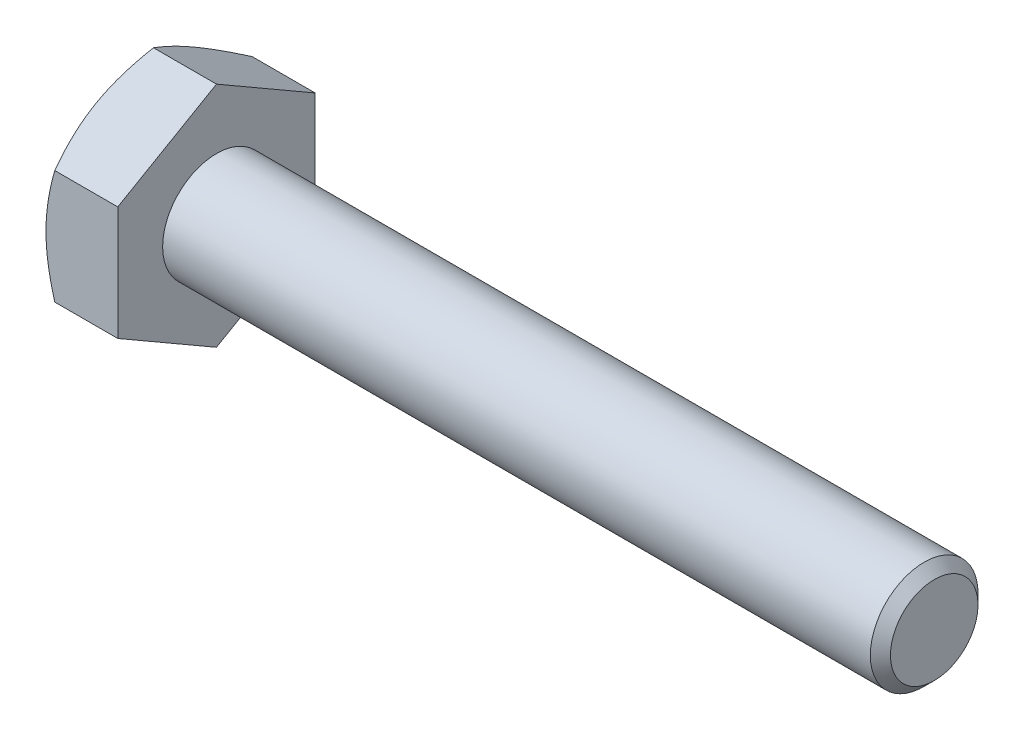
ISO-10303-21;
HEADER;
FILE_DESCRIPTION(('STEP AP214'),'2;1');
FILE_NAME('part.step','',(''),(''),'','','');
FILE_SCHEMA(('AUTOMOTIVE_DESIGN { 1 0 10303 214 1 1 1 1 }'));
ENDSEC;
DATA;
#1=APPLICATION_CONTEXT('core data for automotive mechanical design processes');
#2=APPLICATION_PROTOCOL_DEFINITION('international standard','automotive_design',2000,#1);
#3=PRODUCT_CONTEXT('',#1,'mechanical');
#4=PRODUCT('Part','Part','',(#3));
#5=PRODUCT_RELATED_PRODUCT_CATEGORY('part','',(#4));
#6=PRODUCT_DEFINITION_FORMATION('','',#4);
#7=PRODUCT_DEFINITION_CONTEXT('part definition',#1,'design');
#8=PRODUCT_DEFINITION('design','',#6,#7);
#9=PRODUCT_DEFINITION_SHAPE('','',#8);
#10=(LENGTH_UNIT() NAMED_UNIT(*) SI_UNIT(.MILLI.,.METRE.));
#11=(NAMED_UNIT(*) PLANE_ANGLE_UNIT() SI_UNIT($,.RADIAN.));
#12=(NAMED_UNIT(*) SI_UNIT($,.STERADIAN.) SOLID_ANGLE_UNIT());
#13=UNCERTAINTY_MEASURE_WITH_UNIT(LENGTH_MEASURE(1.E-05),#10,'distance_accuracy_value','');
#14=(GEOMETRIC_REPRESENTATION_CONTEXT(3) GLOBAL_UNCERTAINTY_ASSIGNED_CONTEXT((#13)) GLOBAL_UNIT_ASSIGNED_CONTEXT((#10,
#11,#12)) REPRESENTATION_CONTEXT('',''));
#15=CARTESIAN_POINT('',(0.,0.,0.));
#16=DIRECTION('',(0.,0.,1.));
#17=DIRECTION('',(1.,0.,0.));
#18=AXIS2_PLACEMENT_3D('',#15,#16,#17);
#19=CARTESIAN_POINT('',(0.247093813641186,0.,0.));
#20=DIRECTION('',(1.,0.,0.));
#21=DIRECTION('',(0.,0.,-1.));
#22=AXIS2_PLACEMENT_3D('',#19,#20,#21);
#23=CONICAL_SURFACE('',#22,3.17797903943529,1.04719755123487);
#24=CARTESIAN_POINT('',(0.245620125353297,1.58771319441333,2.75000000445292));
#25=CARTESIAN_POINT('',(0.208302611422687,1.65233280567374,2.63807560337087));
#26=CARTESIAN_POINT('',(0.174113261156258,1.71746990227843,2.52525486193825));
#27=CARTESIAN_POINT('',(0.113820963780644,1.84831826254583,2.29861886752376));
#28=CARTESIAN_POINT('',(0.0876780311517107,1.91402496214773,2.1848115198531));
#29=CARTESIAN_POINT('',(0.0555789468827624,2.01320512582813,2.01302643538274));
#30=CARTESIAN_POINT('',(0.0460612413090582,2.04639046653045,1.95554773967643));
#31=CARTESIAN_POINT('',(0.0295858946939324,2.11292001944978,1.84031517415182));
#32=CARTESIAN_POINT('',(0.0226281862702107,2.14626422746179,1.78256131161678));
#33=CARTESIAN_POINT('',(0.0113950805415364,2.21323485146645,1.66656478812953));
#34=CARTESIAN_POINT('',(0.00713332393689443,2.24686184385269,1.60832112883504));
#35=CARTESIAN_POINT('',(0.00142988484881121,2.31418196205708,1.49171926378192));
#36=CARTESIAN_POINT('',(-1.12391256473976E-05,2.34787509965072,1.43336103762754));
#37=CARTESIAN_POINT('',(3.7544688643896E-11,2.38156986040678,1.37500000000073));
#38=B_SPLINE_CURVE_WITH_KNOTS('',3,(#24,#25,#26,#27,#28,#29,#30,#31,#32,#33,#34,#35,#36,#37),
.UNSPECIFIED.,.F.,.F.,(4,2,2,2,2,2,4),(0.,0.40372017155036,0.805400455914915,1.00650414182376,
1.20760253405543,1.40971045201377,1.61185838499262),.UNSPECIFIED.);
#39=CARTESIAN_POINT('',(0.245620097887813,1.58771323194011,2.75000001443034));
#40=VERTEX_POINT('',#39);
#41=CARTESIAN_POINT('',(1.87722046035099E-11,2.38156986037905,1.37499999998374));
#42=VERTEX_POINT('',#41);
#43=EDGE_CURVE('E97',#40,#42,#38,.T.);
#44=ORIENTED_EDGE('',*,*,#43,.T.);
#45=CARTESIAN_POINT('',(0.,0.,0.));
#46=DIRECTION('',(1.,0.,0.));
#47=DIRECTION('',(0.,0.,-1.));
#48=AXIS2_PLACEMENT_3D('',#45,#46,#47);
#49=CIRCLE('',#48,2.74999999993497);
#50=CARTESIAN_POINT('',(1.87723355258448E-11,0.,2.74999999996749));
#51=VERTEX_POINT('',#50);
#52=EDGE_CURVE('E99',#42,#51,#49,.T.);
#53=ORIENTED_EDGE('',*,*,#52,.T.);
#54=CARTESIAN_POINT('',(4.22381346782145E-11,0.,2.74999999999187));
#55=CARTESIAN_POINT('',(-1.12391058102522E-05,0.0673895163244944,2.74999999999708));
#56=CARTESIAN_POINT('',(0.00142988463489068,0.134775786268163,2.74999999999922));
#57=CARTESIAN_POINT('',(0.00713332282774625,0.269416012273883,2.75000000000078));
#58=CARTESIAN_POINT('',(0.0113950787733437,0.336669991886818,2.75000000000021));
#59=CARTESIAN_POINT('',(0.022628182843835,0.470611229931148,2.74999999999979));
#60=CARTESIAN_POINT('',(0.0295858902768044,0.537299641148356,2.74999999999994));
#61=CARTESIAN_POINT('',(0.0460612343882111,0.670358736952928,2.75000000000006));
#62=CARTESIAN_POINT('',(0.0555789384476848,0.736729413130461,2.75000000000002));
#63=CARTESIAN_POINT('',(0.0876780186705048,0.935089727171406,2.74999999999996));
#64=CARTESIAN_POINT('',(0.113820949287115,1.06650312094283,2.74999999999998));
#65=CARTESIAN_POINT('',(0.174113234168371,1.32819981107726,2.75000000000002));
#66=CARTESIAN_POINT('',(0.208302573892446,1.45847397922507,2.75000000000004));
#67=CARTESIAN_POINT('',(0.245620068079388,1.58771315367478,2.75));
#68=B_SPLINE_CURVE_WITH_KNOTS('',3,(#54,#55,#56,#57,#58,#59,#60,#61,#62,#63,#64,#65,#66,#67),
.UNSPECIFIED.,.F.,.F.,(4,2,2,2,2,2,4),(0.,0.202147917307019,0.404255819764308,0.605354197062228,
0.806457867938704,1.20813812131784,1.61185826082473),.UNSPECIFIED.);
#69=EDGE_CURVE('E20',#51,#40,#68,.T.);
#70=ORIENTED_EDGE('',*,*,#69,.T.);
#71=EDGE_LOOP('',(#44,#53,#70));
#72=FACE_BOUND('',#71,.T.);
#73=ADVANCED_FACE('F16',(#72),#23,.T.);
#74=CARTESIAN_POINT('',(0.247093813641186,0.,0.));
#75=DIRECTION('',(1.,0.,0.));
#76=DIRECTION('',(0.,0.,-1.));
#77=AXIS2_PLACEMENT_3D('',#74,#75,#76);
#78=CONICAL_SURFACE('',#77,3.17797903943529,1.04719755123487);
#79=CARTESIAN_POINT('',(0.,0.,0.));
#80=DIRECTION('',(1.,0.,0.));
#81=DIRECTION('',(0.,0.,-1.));
#82=AXIS2_PLACEMENT_3D('',#79,#80,#81);
#83=CIRCLE('',#82,2.74999999993497);
#84=CARTESIAN_POINT('',(1.87714326470167E-11,-2.38156986037904,1.37499999998375));
#85=VERTEX_POINT('',#84);
#86=EDGE_CURVE('E105',#51,#85,#83,.T.);
#87=ORIENTED_EDGE('',*,*,#86,.T.);
#88=CARTESIAN_POINT('',(4.22355327327212E-11,-2.38156986040016,1.37499999999594));
#89=CARTESIAN_POINT('',(-1.12391090629137E-05,-2.34787509976059,1.43336103738297));
#90=CARTESIAN_POINT('',(0.00142988484548734,-2.31418196230934,1.4917192633192));
#91=CARTESIAN_POINT('',(0.00713332387587586,-2.2468618443607,1.60832112798091));
#92=CARTESIAN_POINT('',(0.0113950804449148,-2.21323485208785,1.66656478710207));
#93=CARTESIAN_POINT('',(0.0226281861408932,-2.14626422818741,1.78256131031138));
#94=CARTESIAN_POINT('',(0.0295858945726209,-2.11292002016673,1.84031517274164));
#95=CARTESIAN_POINT('',(0.0460612410196586,-2.04639046747194,1.95554773821407));
#96=CARTESIAN_POINT('',(0.0555789464160417,-2.01320512700276,2.0130264339731));
#97=CARTESIAN_POINT('',(0.0876780310743108,-1.91402496292124,2.18481151726518));
#98=CARTESIAN_POINT('',(0.113820965219894,-1.8483182614099,2.29861886268063));
#99=CARTESIAN_POINT('',(0.174113257978256,-1.71746990717717,2.52525486029856));
#100=CARTESIAN_POINT('',(0.208302602058572,-1.65233281856459,2.63807560723271));
#101=CARTESIAN_POINT('',(0.245620100813993,-1.58771322687181,2.75000002320889));
#102=B_SPLINE_CURVE_WITH_KNOTS('',3,(#88,#89,#90,#91,#92,#93,#94,#95,#96,#97,#98,#99,#100,#101),
.UNSPECIFIED.,.F.,.F.,(4,2,2,2,2,2,4),(0.,0.202147932192761,0.404255849521308,0.605354241514827,
0.806457927089489,1.20813820971334,1.61185837882308),.UNSPECIFIED.);
#103=CARTESIAN_POINT('',(0.245620080576418,-1.58771319696576,2.75));
#104=VERTEX_POINT('',#103);
#105=EDGE_CURVE('E113',#85,#104,#102,.T.);
#106=ORIENTED_EDGE('',*,*,#105,.T.);
#107=CARTESIAN_POINT('',(0.245620068075139,-1.58771315366006,2.75));
#108=CARTESIAN_POINT('',(0.208302573888836,-1.45847397921159,2.75));
#109=CARTESIAN_POINT('',(0.174113234165332,-1.32819981106503,2.75));
#110=CARTESIAN_POINT('',(0.113820949285087,-1.06650312093308,2.75));
#111=CARTESIAN_POINT('',(0.087678018668921,-0.935089727162875,2.75));
#112=CARTESIAN_POINT('',(0.0555789384467154,-0.736729413123844,2.75));
#113=CARTESIAN_POINT('',(0.0460612343874404,-0.670358736946991,2.75));
#114=CARTESIAN_POINT('',(0.0295858902762722,-0.537299641143775,2.75));
#115=CARTESIAN_POINT('',(0.0226281828433432,-0.470611229927245,2.75));
#116=CARTESIAN_POINT('',(0.0113950787732987,-0.336669991884315,2.75));
#117=CARTESIAN_POINT('',(0.00713332282810784,-0.269416012272102,2.75));
#118=CARTESIAN_POINT('',(0.00142988463444215,-0.134775786267896,2.75));
#119=CARTESIAN_POINT('',(-1.12391074772275E-05,-0.0673895163250198,2.75));
#120=CARTESIAN_POINT('',(3.75448565939036E-11,-1.35484145061668E-12,2.75));
#121=B_SPLINE_CURVE_WITH_KNOTS('',3,(#107,#108,#109,#110,#111,#112,#113,#114,#115,#116,#117,
#118,#119,#120),.UNSPECIFIED.,.F.,.F.,(4,2,2,2,2,2,4),(0.,0.403720139502818,0.805400392878097,
1.00650406375248,1.20760244104835,1.40971034350344,1.61185826080816),.UNSPECIFIED.);
#122=EDGE_CURVE('E92',#104,#51,#121,.T.);
#123=ORIENTED_EDGE('',*,*,#122,.T.);
#124=EDGE_LOOP('',(#87,#106,#123));
#125=FACE_BOUND('',#124,.T.);
#126=ADVANCED_FACE('F111',(#125),#78,.T.);
#127=CARTESIAN_POINT('',(0.247093813641186,0.,0.));
#128=DIRECTION('',(1.,0.,0.));
#129=DIRECTION('',(0.,0.,-1.));
#130=AXIS2_PLACEMENT_3D('',#127,#128,#129);
#131=CONICAL_SURFACE('',#130,3.17797903943529,1.04719755123487);
#132=CARTESIAN_POINT('',(0.,0.,0.));
#133=DIRECTION('',(1.,0.,0.));
#134=DIRECTION('',(0.,0.,-1.));
#135=AXIS2_PLACEMENT_3D('',#132,#133,#134);
#136=CIRCLE('',#135,2.74999999993497);
#137=CARTESIAN_POINT('',(1.87728723651738E-11,-2.38156986037905,-1.37499999998374));
#138=VERTEX_POINT('',#137);
#139=EDGE_CURVE('E119',#85,#138,#136,.T.);
#140=ORIENTED_EDGE('',*,*,#139,.T.);
#141=CARTESIAN_POINT('',(4.22390068352306E-11,-2.38156986040017,-1.37499999999593));
#142=CARTESIAN_POINT('',(-1.12391090599107E-05,-2.41526462104877,-1.31663896261411));
#143=CARTESIAN_POINT('',(0.00142988484549062,-2.44895775850372,-1.25828073668));
#144=CARTESIAN_POINT('',(0.00713332387588072,-2.51627787645508,-1.14167887201984));
#145=CARTESIAN_POINT('',(0.0113950804449209,-2.54990486872695,-1.0834352128981));
#146=CARTESIAN_POINT('',(0.0226281861409026,-2.61687549262667,-0.967438689688359));
#147=CARTESIAN_POINT('',(0.0295858945726322,-2.65021970064762,-0.909684827258233));
#148=CARTESIAN_POINT('',(0.0460612410196744,-2.71674925334261,-0.794452261785903));
#149=CARTESIAN_POINT('',(0.0555789464160601,-2.74993459381174,-0.736973566026831));
#150=CARTESIAN_POINT('',(0.0876780310743379,-2.84911475789316,-0.565188482734663));
#151=CARTESIAN_POINT('',(0.113820965219928,-2.91482145940455,-0.451381137319217));
#152=CARTESIAN_POINT('',(0.174113257978306,-3.04566981363736,-0.224745139701297));
#153=CARTESIAN_POINT('',(0.20830260205863,-3.11080690224999,-0.111924392767153));
#154=CARTESIAN_POINT('',(0.24562010081406,-3.17542649394271,2.32090819950531E-08));
#155=B_SPLINE_CURVE_WITH_KNOTS('',3,(#141,#142,#143,#144,#145,#146,#147,#148,#149,#150,#151,
#152,#153,#154),.UNSPECIFIED.,.F.,.F.,(4,2,2,2,2,2,4),(0.,0.20214793219279,0.404255849521367,
0.605354241514915,0.806457927089606,1.20813820971351,1.61185837882331),.UNSPECIFIED.);
#156=CARTESIAN_POINT('',(0.245620080576386,-3.17542645889003,3.75039411458215E-08));
#157=VERTEX_POINT('',#156);
#158=EDGE_CURVE('E173',#138,#157,#155,.T.);
#159=ORIENTED_EDGE('',*,*,#158,.T.);
#160=CARTESIAN_POINT('',(0.245620068075073,-3.17542643723712,7.5007882291606E-08));
#161=CARTESIAN_POINT('',(0.208302573888778,-3.11080685001289,0.111924483244372));
#162=CARTESIAN_POINT('',(0.174113234165283,-3.04566976593963,0.224745222316159));
#163=CARTESIAN_POINT('',(0.113820949285053,-2.91482142087366,0.451381204056706));
#164=CARTESIAN_POINT('',(0.0876780186688948,-2.84911472398857,0.565188541459212));
#165=CARTESIAN_POINT('',(0.0555789384466978,-2.74993456696907,0.736973612519647));
#166=CARTESIAN_POINT('',(0.0460612343874254,-2.71674922888065,0.794452304155145));
#167=CARTESIAN_POINT('',(0.0295858902762617,-2.65021968097905,0.9096848613253));
#168=CARTESIAN_POINT('',(0.0226281828433347,-2.61687547537079,0.96743871957683));
#169=CARTESIAN_POINT('',(0.0113950787732934,-2.54990485634933,1.08343523433633));
#170=CARTESIAN_POINT('',(0.00713332282810379,-2.51627786654323,1.1416788891861));
#171=CARTESIAN_POINT('',(0.00142988463443976,-2.44895775354114,1.258280745277));
#172=CARTESIAN_POINT('',(-1.12391074792164E-05,-2.41526461856971,1.3166389669138));
#173=CARTESIAN_POINT('',(3.75428068345179E-11,-2.38156986040788,1.37499999999883));
#174=B_SPLINE_CURVE_WITH_KNOTS('',3,(#160,#161,#162,#163,#164,#165,#166,#167,#168,#169,#170,
#171,#172,#173),.UNSPECIFIED.,.F.,.F.,(4,2,2,2,2,2,4),(0.,0.40372013950276,0.80540039287798,
1.00650406375234,1.20760244104817,1.40971034350323,1.61185826080793),.UNSPECIFIED.);
#175=EDGE_CURVE('E191',#157,#85,#174,.T.);
#176=ORIENTED_EDGE('',*,*,#175,.T.);
#177=EDGE_LOOP('',(#140,#159,#176));
#178=FACE_BOUND('',#177,.T.);
#179=ADVANCED_FACE('F156',(#178),#131,.T.);
#180=CARTESIAN_POINT('',(0.247093813641186,0.,0.));
#181=DIRECTION('',(1.,0.,0.));
#182=DIRECTION('',(0.,0.,-1.));
#183=AXIS2_PLACEMENT_3D('',#180,#181,#182);
#184=CONICAL_SURFACE('',#183,3.17797903943529,1.04719755123487);
#185=CARTESIAN_POINT('',(0.,0.,0.));
#186=DIRECTION('',(1.,0.,0.));
#187=DIRECTION('',(0.,0.,-1.));
#188=AXIS2_PLACEMENT_3D('',#185,#186,#187);
#189=CIRCLE('',#188,2.74999999993497);
#190=CARTESIAN_POINT('',(1.87723179206211E-11,0.,-2.74999999996749));
#191=VERTEX_POINT('',#190);
#192=EDGE_CURVE('E121',#138,#191,#189,.T.);
#193=ORIENTED_EDGE('',*,*,#192,.T.);
#194=CARTESIAN_POINT('',(4.22375984152944E-11,0.,-2.74999999999187));
#195=CARTESIAN_POINT('',(-1.12391090603024E-05,-0.0673895212871096,-2.74999999999708));
#196=CARTESIAN_POINT('',(0.00142988484544432,-0.134775796192243,-2.74999999999922));
#197=CARTESIAN_POINT('',(0.00713332387565435,-0.269416032090136,-2.75000000000078));
#198=CARTESIAN_POINT('',(0.0113950804445604,-0.33667001663379,-2.75000000000021));
#199=CARTESIAN_POINT('',(0.0226281861401926,-0.470611264431866,-2.74999999999979));
#200=CARTESIAN_POINT('',(0.0295858945717077,-0.537299680472463,-2.74999999999994));
#201=CARTESIAN_POINT('',(0.0460612410182478,-0.67035878586019,-2.75000000000006));
#202=CARTESIAN_POINT('',(0.0555789464143461,-0.736729466797483,-2.75000000000002));
#203=CARTESIAN_POINT('',(0.0876780310716703,-0.935089794957403,-2.74999999999996));
#204=CARTESIAN_POINT('',(0.113820965216502,-1.06650319797815,-2.74999999999998));
#205=CARTESIAN_POINT('',(0.174113257973186,-1.32819990643977,-2.75000000000002));
#206=CARTESIAN_POINT('',(0.208302602052574,-1.45847408366303,-2.75000000000004));
#207=CARTESIAN_POINT('',(0.245620100807022,-1.58771326704663,-2.75));
#208=B_SPLINE_CURVE_WITH_KNOTS('',3,(#194,#195,#196,#197,#198,#199,#200,#201,#202,#203,#204,
#205,#206,#207),.UNSPECIFIED.,.F.,.F.,(4,2,2,2,2,2,4),(0.,0.20214793218959,0.40425584951497,
0.605354241505359,0.80645792707689,1.20813820969451,1.61185837879794),.UNSPECIFIED.);
#209=CARTESIAN_POINT('',(0.245620080573249,-1.58771326192994,-2.74999996248657));
#210=VERTEX_POINT('',#209);
#211=EDGE_CURVE('E160',#191,#210,#208,.T.);
#212=ORIENTED_EDGE('',*,*,#211,.T.);
#213=CARTESIAN_POINT('',(0.24562006806875,-1.58771328358825,-2.74999992497315));
#214=CARTESIAN_POINT('',(0.208302573883339,-1.65233287081161,-2.63807551673815));
#215=CARTESIAN_POINT('',(0.174113234160685,-1.717469954884,-2.52525477766789));
#216=CARTESIAN_POINT('',(0.113820949281977,-1.84831829994819,-2.2986187959304));
#217=CARTESIAN_POINT('',(0.0876780186665004,-1.91402499683239,-2.18481145852945));
#218=CARTESIAN_POINT('',(0.0555789384451608,-2.01320515385053,-2.01302638747137));
#219=CARTESIAN_POINT('',(0.046061234386147,-2.04639049193849,-1.95554769583667));
#220=CARTESIAN_POINT('',(0.0295858902754346,-2.11292003983916,-1.84031513866812));
#221=CARTESIAN_POINT('',(0.0226281828427004,-2.14626424544696,-1.7825612804174));
#222=CARTESIAN_POINT('',(0.011395078772973,-2.21323486446747,-1.66656476565953));
#223=CARTESIAN_POINT('',(0.00713332282790397,-2.24686185427309,-1.60832111081059));
#224=CARTESIAN_POINT('',(0.00142988463440191,-2.31418196727423,-1.49171925472134));
#225=CARTESIAN_POINT('',(-1.123910747566E-05,-2.34787510224518,-1.43336103308537));
#226=CARTESIAN_POINT('',(3.75457547262337E-11,-2.38156986040653,-1.37500000000117));
#227=B_SPLINE_CURVE_WITH_KNOTS('',3,(#213,#214,#215,#216,#217,#218,#219,#220,#221,#222,#223,
#224,#225,#226),.UNSPECIFIED.,.F.,.F.,(4,2,2,2,2,2,4),(0.,0.40372013949704,0.80540039286661,
1.00650406373812,1.20760244103112,1.40971034348331,1.61185826078513),.UNSPECIFIED.);
#228=EDGE_CURVE('E166',#210,#138,#227,.T.);
#229=ORIENTED_EDGE('',*,*,#228,.T.);
#230=EDGE_LOOP('',(#193,#212,#229));
#231=FACE_BOUND('',#230,.T.);
#232=ADVANCED_FACE('F149',(#231),#184,.T.);
#233=CARTESIAN_POINT('',(0.247093813641186,0.,0.));
#234=DIRECTION('',(1.,0.,0.));
#235=DIRECTION('',(0.,0.,-1.));
#236=AXIS2_PLACEMENT_3D('',#233,#234,#235);
#237=CONICAL_SURFACE('',#236,3.17797903943529,1.04719755123487);
#238=CARTESIAN_POINT('',(0.245620125363753,1.5877132670472,-2.74999996249191));
#239=CARTESIAN_POINT('',(0.208302611425352,1.45847408677907,-2.74999998689824));
#240=CARTESIAN_POINT('',(0.174113261155965,1.32819991032352,-2.74999999657558));
#241=CARTESIAN_POINT('',(0.113820963778544,1.06650320161643,-2.75000000340712));
#242=CARTESIAN_POINT('',(0.0876780311507348,0.935089797595657,-2.75000000062437));
#243=CARTESIAN_POINT('',(0.0555789468823758,0.73672946861369,-2.74999999968741));
#244=CARTESIAN_POINT('',(0.0460612413086893,0.670358787604863,-2.74999999991583));
#245=CARTESIAN_POINT('',(0.029585894693669,0.537299682058404,-2.75000000008417));
#246=CARTESIAN_POINT('',(0.0226281862700343,0.470611265930763,-2.7500000000241));
#247=CARTESIAN_POINT('',(0.0113950805414743,0.33667001783851,-2.74999999997578));
#248=CARTESIAN_POINT('',(0.0071333239368618,0.269416033087326,-2.74999999998789));
#249=CARTESIAN_POINT('',(0.00142988484880882,0.134775796721124,-2.75000000001211));
#250=CARTESIAN_POINT('',(-1.12391256478905E-05,0.0673895215551175,-2.75000000002423));
#251=CARTESIAN_POINT('',(3.75446358412427E-11,1.35487812364647E-12,-2.75));
#252=B_SPLINE_CURVE_WITH_KNOTS('',3,(#238,#239,#240,#241,#242,#243,#244,#245,#246,#247,#248,
#249,#250,#251),.UNSPECIFIED.,.F.,.F.,(4,2,2,2,2,2,4),(0.,0.403720171549025,0.805400455911902,
1.00650414181961,1.2076025340501,1.40971045200744,1.61185838498538),.UNSPECIFIED.);
#253=CARTESIAN_POINT('',(0.245620097886926,1.58771325693112,-2.75));
#254=VERTEX_POINT('',#253);
#255=EDGE_CURVE('E106',#254,#191,#252,.T.);
#256=ORIENTED_EDGE('',*,*,#255,.T.);
#257=CARTESIAN_POINT('',(0.,0.,0.));
#258=DIRECTION('',(1.,0.,0.));
#259=DIRECTION('',(0.,0.,-1.));
#260=AXIS2_PLACEMENT_3D('',#257,#258,#259);
#261=CIRCLE('',#260,2.74999999993497);
#262=CARTESIAN_POINT('',(1.87719592567345E-11,2.38156986037905,-1.37499999998375));
#263=VERTEX_POINT('',#262);
#264=EDGE_CURVE('E341',#191,#263,#261,.T.);
#265=ORIENTED_EDGE('',*,*,#264,.T.);
#266=CARTESIAN_POINT('',(4.04770625747497E-11,2.3815698604028,-1.37499999999746));
#267=CARTESIAN_POINT('',(-1.12391064425941E-05,2.34787510224422,-1.43336103308339));
#268=CARTESIAN_POINT('',(0.00142988463464879,2.31418196727438,-1.4917192547201));
#269=CARTESIAN_POINT('',(0.00713332282756166,2.24686185427402,-1.60832111080995));
#270=CARTESIAN_POINT('',(0.0113950787728266,2.21323486446806,-1.66656476565876));
#271=CARTESIAN_POINT('',(0.022628182842686,2.14626424544729,-1.78256128041656));
#272=CARTESIAN_POINT('',(0.0295858902753566,2.11292003983956,-1.84031513866735));
#273=CARTESIAN_POINT('',(0.0460612343860133,2.04639049193892,-1.95554769583599));
#274=CARTESIAN_POINT('',(0.0555789384450353,2.01320515385092,-2.01302638747071));
#275=CARTESIAN_POINT('',(0.0876780186663767,1.91402499683273,-2.1848114585288));
#276=CARTESIAN_POINT('',(0.11382094928183,1.84831829994854,-2.29861879592977));
#277=CARTESIAN_POINT('',(0.174113234160503,1.71746995488435,-2.5252547776673));
#278=CARTESIAN_POINT('',(0.208302573883146,1.65233287081195,-2.63807551673761));
#279=CARTESIAN_POINT('',(0.245620068068574,1.58771328358854,-2.74999992497263));
#280=B_SPLINE_CURVE_WITH_KNOTS('',3,(#266,#267,#268,#269,#270,#271,#272,#273,#274,#275,#276,
#277,#278,#279),.UNSPECIFIED.,.F.,.F.,(4,2,2,2,2,2,4),(0.,0.20214791730203,0.40425581975437,
0.605354197047443,0.806457867919058,1.20813812128863,1.61185826078579),.UNSPECIFIED.);
#281=EDGE_CURVE('E133',#263,#254,#280,.T.);
#282=ORIENTED_EDGE('',*,*,#281,.T.);
#283=EDGE_LOOP('',(#256,#265,#282));
#284=FACE_BOUND('',#283,.T.);
#285=ADVANCED_FACE('F144',(#284),#237,.T.);
#286=CARTESIAN_POINT('',(0.,3.17542648054294,0.));
#287=DIRECTION('',(1.,0.,0.));
#288=DIRECTION('',(0.,0.,-1.));
#289=AXIS2_PLACEMENT_3D('',#286,#287,#288);
#290=PLANE('',#289);
#291=ORIENTED_EDGE('',*,*,#192,.F.);
#292=ORIENTED_EDGE('',*,*,#139,.F.);
#293=ORIENTED_EDGE('',*,*,#86,.F.);
#294=ORIENTED_EDGE('',*,*,#52,.F.);
#295=CARTESIAN_POINT('',(0.,0.,0.));
#296=DIRECTION('',(1.,0.,0.));
#297=DIRECTION('',(0.,0.,-1.));
#298=AXIS2_PLACEMENT_3D('',#295,#296,#297);
#299=CIRCLE('',#298,2.74999999993497);
#300=EDGE_CURVE('E342',#263,#42,#299,.T.);
#301=ORIENTED_EDGE('',*,*,#300,.F.);
#302=ORIENTED_EDGE('',*,*,#264,.F.);
#303=EDGE_LOOP('',(#291,#292,#293,#294,#301,#302));
#304=FACE_BOUND('',#303,.T.);
#305=ADVANCED_FACE('F117',(#304),#290,.F.);
#306=CARTESIAN_POINT('',(0.247093813641186,0.,0.));
#307=DIRECTION('',(1.,0.,0.));
#308=DIRECTION('',(0.,0.,-1.));
#309=AXIS2_PLACEMENT_3D('',#306,#307,#308);
#310=CONICAL_SURFACE('',#309,3.17797903943529,1.04719755123487);
#311=CARTESIAN_POINT('',(0.245620093076482,3.17542648054083,-3.65471337437153E-12));
#312=CARTESIAN_POINT('',(0.20830259540095,3.11080688990418,-0.111924414150638));
#313=CARTESIAN_POINT('',(0.174113252350319,3.04566980236441,-0.224745159226576));
#314=CARTESIAN_POINT('',(0.113820961453852,2.91482145029813,-0.451381153092039));
#315=CARTESIAN_POINT('',(0.0876780281423978,2.84911474988013,-0.565188496613726));
#316=CARTESIAN_POINT('',(0.0555789445325779,2.74993458746769,-0.736973577015006));
#317=CARTESIAN_POINT('',(0.0460612394522271,2.71674924756121,-0.794452271799471));
#318=CARTESIAN_POINT('',(0.0295858935572031,2.65021969599919,-0.90968483530966));
#319=CARTESIAN_POINT('',(0.022628185361466,2.61687548854857,-0.967438696752252));
#320=CARTESIAN_POINT('',(0.0113950800499481,2.54990486580153,-1.08343521796464));
#321=CARTESIAN_POINT('',(0.00713332362860263,2.51627787411207,-1.14167887607648));
#322=CARTESIAN_POINT('',(0.00142988479527443,2.44895775733153,-1.25828073871186));
#323=CARTESIAN_POINT('',(-1.12391099678723E-05,2.41526462046499,-1.31663896363107));
#324=CARTESIAN_POINT('',(3.75440665419617E-11,2.38156986040763,-1.37499999999927));
#325=B_SPLINE_CURVE_WITH_KNOTS('',3,(#311,#312,#313,#314,#315,#316,#317,#318,#319,#320,#321,
#322,#323,#324),.UNSPECIFIED.,.F.,.F.,(4,2,2,2,2,2,4),(0.,0.403720162112379,0.805400437823692,
1.00650411992401,1.20760250844383,1.40971042225704,1.61185835093094),.UNSPECIFIED.);
#326=CARTESIAN_POINT('',(0.245620093076482,3.17542648054083,0.));
#327=VERTEX_POINT('',#326);
#328=EDGE_CURVE('E256',#327,#263,#325,.T.);
#329=ORIENTED_EDGE('',*,*,#328,.T.);
#330=ORIENTED_EDGE('',*,*,#300,.T.);
#331=CARTESIAN_POINT('',(4.04780477563994E-11,2.38156986040281,1.37499999999746));
#332=CARTESIAN_POINT('',(-1.12391089250852E-05,2.41526462046305,1.31663896363079));
#333=CARTESIAN_POINT('',(0.00142988479553836,2.44895775733079,1.25828073871217));
#334=CARTESIAN_POINT('',(0.00713332362829232,2.51627787411225,1.14167887607715));
#335=CARTESIAN_POINT('',(0.0113950800498413,2.54990486580143,1.08343521796509));
#336=CARTESIAN_POINT('',(0.0226281853615065,2.61687548854828,0.967438696752498));
#337=CARTESIAN_POINT('',(0.0295858935571877,2.650219695999,0.909684835309925));
#338=CARTESIAN_POINT('',(0.0460612394521711,2.71674924756111,0.794452271799711));
#339=CARTESIAN_POINT('',(0.0555789445325375,2.74993458746759,0.736973577015202));
#340=CARTESIAN_POINT('',(0.0876780281423815,2.84911474988002,0.565188496613858));
#341=CARTESIAN_POINT('',(0.113820961453827,2.91482145029804,0.451381153092166));
#342=CARTESIAN_POINT('',(0.174113252350287,3.04566980236438,0.224745159226663));
#343=CARTESIAN_POINT('',(0.208302595400922,3.11080688990418,0.111924414150691));
#344=CARTESIAN_POINT('',(0.245620093076482,3.17542648054083,3.65516474206373E-12));
#345=B_SPLINE_CURVE_WITH_KNOTS('',3,(#331,#332,#333,#334,#335,#336,#337,#338,#339,#340,#341,
#342,#343,#344),.UNSPECIFIED.,.F.,.F.,(4,2,2,2,2,2,4),(0.,0.20214792867413,0.404255842487507,
0.60535423100742,0.806457913107851,1.2081381888192,1.61185835093172),.UNSPECIFIED.);
#346=EDGE_CURVE('E249',#42,#327,#345,.T.);
#347=ORIENTED_EDGE('',*,*,#346,.T.);
#348=EDGE_LOOP('',(#329,#330,#347));
#349=FACE_BOUND('',#348,.T.);
#350=ADVANCED_FACE('F264',(#349),#310,.T.);
#351=CARTESIAN_POINT('',(22.,0.,0.));
#352=DIRECTION('',(-1.,0.,0.));
#353=DIRECTION('',(0.,0.,1.));
#354=AXIS2_PLACEMENT_3D('',#351,#352,#353);
#355=PLANE('',#354);
#356=CARTESIAN_POINT('',(22.0000000000482,0.,0.));
#357=DIRECTION('',(-1.,0.,0.));
#358=DIRECTION('',(0.,0.,1.));
#359=AXIS2_PLACEMENT_3D('',#356,#357,#358);
#360=CIRCLE('',#359,1.2194999999906);
#361=CARTESIAN_POINT('',(22.0000000000482,0.,1.2194999999906));
#362=VERTEX_POINT('',#361);
#363=EDGE_CURVE('E237',#362,#362,#360,.T.);
#364=ORIENTED_EDGE('',*,*,#363,.F.);
#365=EDGE_LOOP('',(#364));
#366=FACE_BOUND('',#365,.T.);
#367=ADVANCED_FACE('F268',(#366),#355,.F.);
#368=CARTESIAN_POINT('',(2.,1.58771324027147,-2.75));
#369=DIRECTION('',(0.,-0.866025403784438,0.500000000000001));
#370=DIRECTION('',(0.,-0.500000000000001,-0.866025403784438));
#371=AXIS2_PLACEMENT_3D('',#368,#369,#370);
#372=PLANE('',#371);
#373=DIRECTION('',(1.,0.,0.));
#374=VECTOR('',#373,1.);
#375=CARTESIAN_POINT('',(2.,3.17542648054294,0.));
#376=LINE('',#375,#374);
#377=CARTESIAN_POINT('',(2.,3.17542648054294,0.));
#378=VERTEX_POINT('',#377);
#379=EDGE_CURVE('E255',#327,#378,#376,.T.);
#380=ORIENTED_EDGE('',*,*,#379,.T.);
#381=DIRECTION('',(0.,0.500000000000001,0.866025403784438));
#382=VECTOR('',#381,1.);
#383=CARTESIAN_POINT('',(2.,1.58771324027147,-2.75));
#384=LINE('',#383,#382);
#385=CARTESIAN_POINT('',(2.,1.58771324027147,-2.75));
#386=VERTEX_POINT('',#385);
#387=EDGE_CURVE('E239',#386,#378,#384,.T.);
#388=ORIENTED_EDGE('',*,*,#387,.F.);
#389=DIRECTION('',(1.,0.,0.));
#390=VECTOR('',#389,1.);
#391=CARTESIAN_POINT('',(2.,1.58771324027147,-2.75));
#392=LINE('',#391,#390);
#393=EDGE_CURVE('E240',#386,#254,#392,.F.);
#394=ORIENTED_EDGE('',*,*,#393,.T.);
#395=ORIENTED_EDGE('',*,*,#281,.F.);
#396=ORIENTED_EDGE('',*,*,#328,.F.);
#397=EDGE_LOOP('',(#380,#388,#394,#395,#396));
#398=FACE_BOUND('',#397,.T.);
#399=ADVANCED_FACE('F272',(#398),#372,.F.);
#400=CARTESIAN_POINT('',(2.,3.17542648054294,0.));
#401=DIRECTION('',(0.,-0.866025403784438,-0.500000000000001));
#402=DIRECTION('',(0.,0.500000000000001,-0.866025403784438));
#403=AXIS2_PLACEMENT_3D('',#400,#401,#402);
#404=PLANE('',#403);
#405=DIRECTION('',(1.,0.,0.));
#406=VECTOR('',#405,1.);
#407=CARTESIAN_POINT('',(2.,1.58771324027147,2.75));
#408=LINE('',#407,#406);
#409=CARTESIAN_POINT('',(2.,1.58771324027147,2.75));
#410=VERTEX_POINT('',#409);
#411=EDGE_CURVE('E95',#40,#410,#408,.T.);
#412=ORIENTED_EDGE('',*,*,#411,.T.);
#413=DIRECTION('',(0.,-0.500000000000001,0.866025403784438));
#414=VECTOR('',#413,1.);
#415=CARTESIAN_POINT('',(2.,3.17542648054294,0.));
#416=LINE('',#415,#414);
#417=EDGE_CURVE('E243',#378,#410,#416,.T.);
#418=ORIENTED_EDGE('',*,*,#417,.F.);
#419=ORIENTED_EDGE('',*,*,#379,.F.);
#420=ORIENTED_EDGE('',*,*,#346,.F.);
#421=ORIENTED_EDGE('',*,*,#43,.F.);
#422=EDGE_LOOP('',(#412,#418,#419,#420,#421));
#423=FACE_BOUND('',#422,.T.);
#424=ADVANCED_FACE('F262',(#423),#404,.F.);
#425=CARTESIAN_POINT('',(2.,1.58771324027147,2.75));
#426=DIRECTION('',(0.,0.,-1.));
#427=DIRECTION('',(0.,1.,0.));
#428=AXIS2_PLACEMENT_3D('',#425,#426,#427);
#429=PLANE('',#428);
#430=DIRECTION('',(1.,0.,0.));
#431=VECTOR('',#430,1.);
#432=CARTESIAN_POINT('',(2.,-1.58771324027146,2.75));
#433=LINE('',#432,#431);
#434=CARTESIAN_POINT('',(2.,-1.58771324027146,2.75));
#435=VERTEX_POINT('',#434);
#436=EDGE_CURVE('E317',#104,#435,#433,.T.);
#437=ORIENTED_EDGE('',*,*,#436,.T.);
#438=DIRECTION('',(0.,1.,0.));
#439=VECTOR('',#438,1.);
#440=CARTESIAN_POINT('',(2.,3.17542648054294,2.75));
#441=LINE('',#440,#439);
#442=EDGE_CURVE('E292',#410,#435,#441,.F.);
#443=ORIENTED_EDGE('',*,*,#442,.F.);
#444=ORIENTED_EDGE('',*,*,#411,.F.);
#445=ORIENTED_EDGE('',*,*,#69,.F.);
#446=ORIENTED_EDGE('',*,*,#122,.F.);
#447=EDGE_LOOP('',(#437,#443,#444,#445,#446));
#448=FACE_BOUND('',#447,.T.);
#449=ADVANCED_FACE('F90',(#448),#429,.F.);
#450=CARTESIAN_POINT('',(2.,-3.17542648054294,0.));
#451=DIRECTION('',(0.,0.866025403784438,-0.500000000000002));
#452=DIRECTION('',(0.,0.500000000000002,0.866025403784438));
#453=AXIS2_PLACEMENT_3D('',#450,#451,#452);
#454=PLANE('',#453);
#455=DIRECTION('',(1.,0.,0.));
#456=VECTOR('',#455,1.);
#457=CARTESIAN_POINT('',(2.,-3.17542648054294,0.));
#458=LINE('',#457,#456);
#459=CARTESIAN_POINT('',(2.,-3.17542648054294,0.));
#460=VERTEX_POINT('',#459);
#461=EDGE_CURVE('E318',#157,#460,#458,.T.);
#462=ORIENTED_EDGE('',*,*,#461,.T.);
#463=DIRECTION('',(0.,-0.500000000000002,-0.866025403784438));
#464=VECTOR('',#463,1.);
#465=CARTESIAN_POINT('',(2.,-1.58771324027146,2.75));
#466=LINE('',#465,#464);
#467=EDGE_CURVE('E301',#435,#460,#466,.T.);
#468=ORIENTED_EDGE('',*,*,#467,.F.);
#469=ORIENTED_EDGE('',*,*,#436,.F.);
#470=ORIENTED_EDGE('',*,*,#105,.F.);
#471=ORIENTED_EDGE('',*,*,#175,.F.);
#472=EDGE_LOOP('',(#462,#468,#469,#470,#471));
#473=FACE_BOUND('',#472,.T.);
#474=ADVANCED_FACE('F183',(#473),#454,.F.);
#475=CARTESIAN_POINT('',(2.,-1.58771324027147,-2.75));
#476=DIRECTION('',(0.,0.866025403784439,0.499999999999999));
#477=DIRECTION('',(0.,-0.499999999999999,0.866025403784439));
#478=AXIS2_PLACEMENT_3D('',#475,#476,#477);
#479=PLANE('',#478);
#480=DIRECTION('',(1.,0.,0.));
#481=VECTOR('',#480,1.);
#482=CARTESIAN_POINT('',(2.,-1.58771324027164,-2.75));
#483=LINE('',#482,#481);
#484=CARTESIAN_POINT('',(2.,-1.58771324027158,-2.75));
#485=VERTEX_POINT('',#484);
#486=EDGE_CURVE('E40',#210,#485,#483,.T.);
#487=ORIENTED_EDGE('',*,*,#486,.T.);
#488=DIRECTION('',(0.,0.499999999999999,-0.866025403784439));
#489=VECTOR('',#488,1.);
#490=CARTESIAN_POINT('',(2.,-3.17542648054294,0.));
#491=LINE('',#490,#489);
#492=EDGE_CURVE('E298',#460,#485,#491,.T.);
#493=ORIENTED_EDGE('',*,*,#492,.F.);
#494=ORIENTED_EDGE('',*,*,#461,.F.);
#495=ORIENTED_EDGE('',*,*,#158,.F.);
#496=ORIENTED_EDGE('',*,*,#228,.F.);
#497=EDGE_LOOP('',(#487,#493,#494,#495,#496));
#498=FACE_BOUND('',#497,.T.);
#499=ADVANCED_FACE('F179',(#498),#479,.F.);
#500=CARTESIAN_POINT('',(2.,1.58771324027147,-2.75));
#501=DIRECTION('',(0.,0.,1.));
#502=DIRECTION('',(0.,-1.,0.));
#503=AXIS2_PLACEMENT_3D('',#500,#501,#502);
#504=PLANE('',#503);
#505=ORIENTED_EDGE('',*,*,#393,.F.);
#506=DIRECTION('',(0.,1.,0.));
#507=VECTOR('',#506,1.);
#508=CARTESIAN_POINT('',(2.,3.17542648054294,-2.75));
#509=LINE('',#508,#507);
#510=EDGE_CURVE('E296',#485,#386,#509,.T.);
#511=ORIENTED_EDGE('',*,*,#510,.F.);
#512=ORIENTED_EDGE('',*,*,#486,.F.);
#513=ORIENTED_EDGE('',*,*,#211,.F.);
#514=ORIENTED_EDGE('',*,*,#255,.F.);
#515=EDGE_LOOP('',(#505,#511,#512,#513,#514));
#516=FACE_BOUND('',#515,.T.);
#517=ADVANCED_FACE('F140',(#516),#504,.F.);
#518=CARTESIAN_POINT('',(21.7194999999606,0.,0.));
#519=DIRECTION('',(-1.,0.,0.));
#520=DIRECTION('',(0.,0.,1.));
#521=AXIS2_PLACEMENT_3D('',#518,#519,#520);
#522=CONICAL_SURFACE('',#521,1.50000000002137,0.785398163296123);
#523=CARTESIAN_POINT('',(21.7195,0.,0.));
#524=DIRECTION('',(-1.,0.,0.));
#525=DIRECTION('',(0.,0.,1.));
#526=AXIS2_PLACEMENT_3D('',#523,#524,#525);
#527=CIRCLE('',#526,1.5);
#528=CARTESIAN_POINT('',(21.7195,0.,1.5));
#529=VERTEX_POINT('',#528);
#530=EDGE_CURVE('E31',#529,#529,#527,.T.);
#531=ORIENTED_EDGE('',*,*,#530,.F.);
#532=EDGE_LOOP('',(#531));
#533=FACE_BOUND('',#532,.T.);
#534=ORIENTED_EDGE('',*,*,#363,.T.);
#535=EDGE_LOOP('',(#534));
#536=FACE_BOUND('',#535,.T.);
#537=ADVANCED_FACE('F222',(#533,#536),#522,.T.);
#538=CARTESIAN_POINT('',(2.,3.17542648054294,0.));
#539=DIRECTION('',(1.,0.,0.));
#540=DIRECTION('',(0.,0.,-1.));
#541=AXIS2_PLACEMENT_3D('',#538,#539,#540);
#542=PLANE('',#541);
#543=CARTESIAN_POINT('',(2.,0.,0.));
#544=DIRECTION('',(-1.,0.,0.));
#545=DIRECTION('',(0.,0.,1.));
#546=AXIS2_PLACEMENT_3D('',#543,#544,#545);
#547=CIRCLE('',#546,1.5);
#548=CARTESIAN_POINT('',(2.,0.,1.5));
#549=VERTEX_POINT('',#548);
#550=EDGE_CURVE('E11',#549,#549,#547,.F.);
#551=ORIENTED_EDGE('',*,*,#550,.F.);
#552=EDGE_LOOP('',(#551));
#553=FACE_BOUND('',#552,.T.);
#554=ORIENTED_EDGE('',*,*,#492,.T.);
#555=ORIENTED_EDGE('',*,*,#510,.T.);
#556=ORIENTED_EDGE('',*,*,#387,.T.);
#557=ORIENTED_EDGE('',*,*,#417,.T.);
#558=ORIENTED_EDGE('',*,*,#442,.T.);
#559=ORIENTED_EDGE('',*,*,#467,.T.);
#560=EDGE_LOOP('',(#554,#555,#556,#557,#558,#559));
#561=FACE_BOUND('',#560,.T.);
#562=ADVANCED_FACE('F216',(#553,#561),#542,.T.);
#563=CARTESIAN_POINT('',(0.,0.,0.));
#564=DIRECTION('',(-1.,0.,0.));
#565=DIRECTION('',(0.,0.,1.));
#566=AXIS2_PLACEMENT_3D('',#563,#564,#565);
#567=CYLINDRICAL_SURFACE('',#566,1.5);
#568=ORIENTED_EDGE('',*,*,#550,.T.);
#569=EDGE_LOOP('',(#568));
#570=FACE_BOUND('',#569,.T.);
#571=ORIENTED_EDGE('',*,*,#530,.T.);
#572=EDGE_LOOP('',(#571));
#573=FACE_BOUND('',#572,.T.);
#574=ADVANCED_FACE('F214',(#570,#573),#567,.T.);
#575=CLOSED_SHELL('',(#73,#126,#179,#232,#285,#305,#350,#367,#399,#424,#449,#474,#499,#517,#537,
#562,#574));
#576=MANIFOLD_SOLID_BREP('B1',#575);
#577=ADVANCED_BREP_SHAPE_REPRESENTATION('',(#18,#576),#14);
#578=SHAPE_DEFINITION_REPRESENTATION(#9,#577);
ENDSEC;
END-ISO-10303-21;
